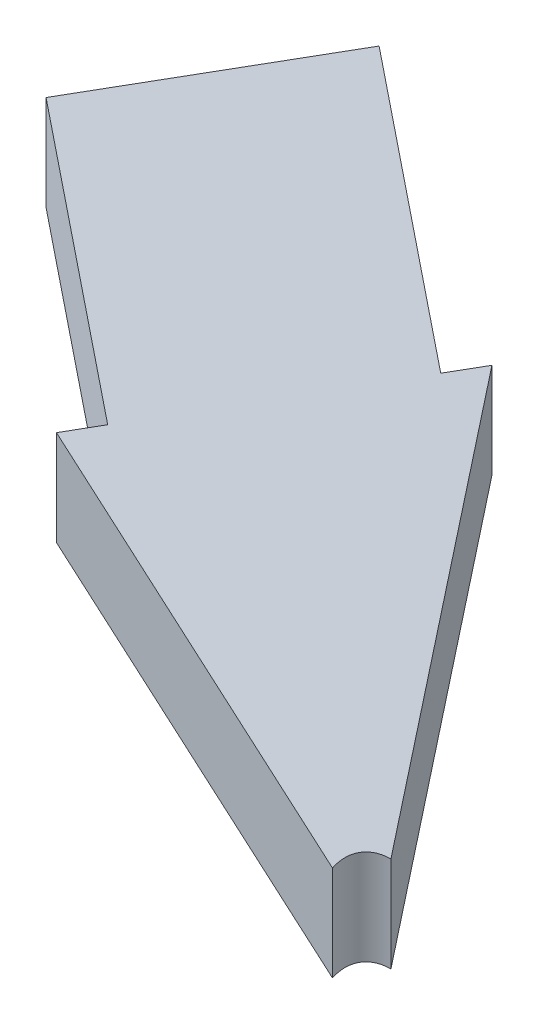
ISO-10303-21;
HEADER;
FILE_DESCRIPTION(('STEP AP214'),'2;1');
FILE_NAME('part.step','',(''),(''),'','','');
FILE_SCHEMA(('AUTOMOTIVE_DESIGN { 1 0 10303 214 1 1 1 1 }'));
ENDSEC;
DATA;
#1=APPLICATION_CONTEXT('core data for automotive mechanical design processes');
#2=APPLICATION_PROTOCOL_DEFINITION('international standard','automotive_design',2000,#1);
#3=PRODUCT_CONTEXT('',#1,'mechanical');
#4=PRODUCT('Part','Part','',(#3));
#5=PRODUCT_RELATED_PRODUCT_CATEGORY('part','',(#4));
#6=PRODUCT_DEFINITION_FORMATION('','',#4);
#7=PRODUCT_DEFINITION_CONTEXT('part definition',#1,'design');
#8=PRODUCT_DEFINITION('design','',#6,#7);
#9=PRODUCT_DEFINITION_SHAPE('','',#8);
#10=(LENGTH_UNIT() NAMED_UNIT(*) SI_UNIT(.MILLI.,.METRE.));
#11=(NAMED_UNIT(*) PLANE_ANGLE_UNIT() SI_UNIT($,.RADIAN.));
#12=(NAMED_UNIT(*) SI_UNIT($,.STERADIAN.) SOLID_ANGLE_UNIT());
#13=UNCERTAINTY_MEASURE_WITH_UNIT(LENGTH_MEASURE(1.E-05),#10,'distance_accuracy_value','');
#14=(GEOMETRIC_REPRESENTATION_CONTEXT(3) GLOBAL_UNCERTAINTY_ASSIGNED_CONTEXT((#13)) GLOBAL_UNIT_ASSIGNED_CONTEXT((#10,
#11,#12)) REPRESENTATION_CONTEXT('',''));
#15=CARTESIAN_POINT('',(0.,0.,0.));
#16=DIRECTION('',(0.,0.,1.));
#17=DIRECTION('',(1.,0.,0.));
#18=AXIS2_PLACEMENT_3D('',#15,#16,#17);
#19=CARTESIAN_POINT('',(0.,254.,0.));
#20=DIRECTION('',(-0.866025403784438,0.,0.5));
#21=DIRECTION('',(0.5,0.,0.866025403784438));
#22=AXIS2_PLACEMENT_3D('',#19,#20,#21);
#23=PLANE('',#22);
#24=DIRECTION('',(0.,-1.,0.));
#25=VECTOR('',#24,1.);
#26=CARTESIAN_POINT('',(-23.6662432702594,80.1332714854436,-40.9911357683742));
#27=LINE('',#26,#25);
#28=CARTESIAN_POINT('',(-23.6662432702594,55.1332714854434,-40.9911357683742));
#29=VERTEX_POINT('',#28);
#30=CARTESIAN_POINT('',(-23.6662432702594,40.9911357683744,-40.9911357683742));
#31=VERTEX_POINT('',#30);
#32=EDGE_CURVE('E142',#29,#31,#27,.T.);
#33=ORIENTED_EDGE('',*,*,#32,.F.);
#34=DIRECTION('',(0.377964473009227,-0.654653670707979,0.654653670707976));
#35=VECTOR('',#34,1.);
#36=CARTESIAN_POINT('',(-59.349429647571,116.938363266897,-102.796227549828));
#37=LINE('',#36,#35);
#38=CARTESIAN_POINT('',(-3.17499999999998,19.6413970311002,-5.4992613140312));
#39=VERTEX_POINT('',#38);
#40=EDGE_CURVE('E163',#29,#39,#37,.T.);
#41=ORIENTED_EDGE('',*,*,#40,.T.);
#42=DIRECTION('',(0.,-1.,0.));
#43=VECTOR('',#42,1.);
#44=CARTESIAN_POINT('',(-3.17499999999998,254.,-5.4992613140312));
#45=LINE('',#44,#43);
#46=CARTESIAN_POINT('',(-3.17499999999998,5.4992613140312,-5.4992613140312));
#47=VERTEX_POINT('',#46);
#48=EDGE_CURVE('E186',#47,#39,#45,.F.);
#49=ORIENTED_EDGE('',*,*,#48,.F.);
#50=DIRECTION('',(0.377964473009227,-0.654653670707979,0.654653670707976));
#51=VECTOR('',#50,1.);
#52=CARTESIAN_POINT('',(-62.848700731785,108.857142857143,-108.857142857143));
#53=LINE('',#52,#51);
#54=EDGE_CURVE('E183',#31,#47,#53,.T.);
#55=ORIENTED_EDGE('',*,*,#54,.F.);
#56=EDGE_LOOP('',(#33,#41,#49,#55));
#57=FACE_BOUND('',#56,.T.);
#58=ADVANCED_FACE('F46',(#57),#23,.F.);
#59=CARTESIAN_POINT('',(0.,254.,0.));
#60=DIRECTION('',(0.,0.,1.));
#61=DIRECTION('',(1.,0.,0.));
#62=AXIS2_PLACEMENT_3D('',#59,#60,#61);
#63=PLANE('',#62);
#64=DIRECTION('',(0.755928946018453,-0.654653670707978,0.));
#65=VECTOR('',#64,1.);
#66=CARTESIAN_POINT('',(-118.698859295142,116.938363266897,0.));
#67=LINE('',#66,#65);
#68=CARTESIAN_POINT('',(-47.3324865405187,55.1332714854434,0.));
#69=VERTEX_POINT('',#68);
#70=CARTESIAN_POINT('',(-6.35,19.6413970311003,0.));
#71=VERTEX_POINT('',#70);
#72=EDGE_CURVE('E166',#69,#71,#67,.T.);
#73=ORIENTED_EDGE('',*,*,#72,.F.);
#74=DIRECTION('',(0.,-1.,0.));
#75=VECTOR('',#74,1.);
#76=CARTESIAN_POINT('',(-47.3324865405187,80.1332714854436,0.));
#77=LINE('',#76,#75);
#78=CARTESIAN_POINT('',(-47.3324865405187,40.9911357683744,0.));
#79=VERTEX_POINT('',#78);
#80=EDGE_CURVE('E130',#69,#79,#77,.T.);
#81=ORIENTED_EDGE('',*,*,#80,.T.);
#82=DIRECTION('',(0.755928946018453,-0.654653670707978,0.));
#83=VECTOR('',#82,1.);
#84=CARTESIAN_POINT('',(-125.69740146357,108.857142857143,0.));
#85=LINE('',#84,#83);
#86=CARTESIAN_POINT('',(-6.34999999999998,5.49926131403115,0.));
#87=VERTEX_POINT('',#86);
#88=EDGE_CURVE('E70',#79,#87,#85,.T.);
#89=ORIENTED_EDGE('',*,*,#88,.T.);
#90=DIRECTION('',(0.,-1.,0.));
#91=VECTOR('',#90,1.);
#92=CARTESIAN_POINT('',(-6.35,254.,0.));
#93=LINE('',#92,#91);
#94=EDGE_CURVE('E190',#87,#71,#93,.F.);
#95=ORIENTED_EDGE('',*,*,#94,.T.);
#96=EDGE_LOOP('',(#73,#81,#89,#95));
#97=FACE_BOUND('',#96,.T.);
#98=ADVANCED_FACE('F216',(#97),#63,.T.);
#99=CARTESIAN_POINT('',(0.,0.,0.));
#100=DIRECTION('',(-0.612372435695796,-0.707106781186546,-0.353553390593274));
#101=DIRECTION('',(0.126826484044323,0.353553390593274,-0.926776695296637));
#102=AXIS2_PLACEMENT_3D('',#99,#100,#101);
#103=PLANE('',#102);
#104=ORIENTED_EDGE('',*,*,#88,.F.);
#105=DIRECTION('',(0.5,0.,-0.866025403784439));
#106=VECTOR('',#105,1.);
#107=CARTESIAN_POINT('',(-35.499364905389,40.9911357683744,-20.4955678841871));
#108=LINE('',#107,#106);
#109=CARTESIAN_POINT('',(-44.5493649053891,40.9911357683744,-4.82050807568875));
#110=VERTEX_POINT('',#109);
#111=EDGE_CURVE('E150',#79,#110,#108,.T.);
#112=ORIENTED_EDGE('',*,*,#111,.T.);
#113=DIRECTION('',(0.612372435695793,-0.707106781186549,0.353553390593274));
#114=VECTOR('',#113,1.);
#115=CARTESIAN_POINT('',(-9.05000000000006,0.,15.6750598084984));
#116=LINE('',#115,#114);
#117=CARTESIAN_POINT('',(-66.2,65.9911357683745,-17.3205080756888));
#118=VERTEX_POINT('',#117);
#119=EDGE_CURVE('E133',#118,#110,#116,.T.);
#120=ORIENTED_EDGE('',*,*,#119,.F.);
#121=DIRECTION('',(-0.5,0.,0.866025403784439));
#122=VECTOR('',#121,1.);
#123=CARTESIAN_POINT('',(-38.1,65.9911357683746,-65.9911357683743));
#124=LINE('',#123,#122);
#125=CARTESIAN_POINT('',(-48.1,65.9911357683745,-48.6706276926854));
#126=VERTEX_POINT('',#125);
#127=EDGE_CURVE('E172',#126,#118,#124,.T.);
#128=ORIENTED_EDGE('',*,*,#127,.F.);
#129=DIRECTION('',(-0.612372435695794,0.707106781186549,-0.353553390593272));
#130=VECTOR('',#129,1.);
#131=CARTESIAN_POINT('',(9.05000000000004,0.,-15.6750598084985));
#132=LINE('',#131,#130);
#133=CARTESIAN_POINT('',(-26.449364905389,40.9911357683744,-36.1706276926855));
#134=VERTEX_POINT('',#133);
#135=EDGE_CURVE('E158',#134,#126,#132,.T.);
#136=ORIENTED_EDGE('',*,*,#135,.F.);
#137=DIRECTION('',(0.5,0.,-0.866025403784439));
#138=VECTOR('',#137,1.);
#139=CARTESIAN_POINT('',(-35.4993649053891,40.9911357683744,-20.4955678841871));
#140=LINE('',#139,#138);
#141=EDGE_CURVE('E139',#134,#31,#140,.T.);
#142=ORIENTED_EDGE('',*,*,#141,.T.);
#143=ORIENTED_EDGE('',*,*,#54,.T.);
#144=CARTESIAN_POINT('',(0.,0.,0.));
#145=DIRECTION('',(-0.612372435695796,-0.707106781186546,-0.353553390593274));
#146=DIRECTION('',(0.612372435695793,-0.707106781186549,0.353553390593273));
#147=AXIS2_PLACEMENT_3D('',#144,#145,#146);
#148=ELLIPSE('',#147,8.98025612106917,6.35);
#149=EDGE_CURVE('E179',#87,#47,#148,.T.);
#150=ORIENTED_EDGE('',*,*,#149,.F.);
#151=EDGE_LOOP('',(#104,#112,#120,#128,#136,#142,#143,#150));
#152=FACE_BOUND('',#151,.T.);
#153=ADVANCED_FACE('F212',(#152),#103,.T.);
#154=CARTESIAN_POINT('',(6.12372439737453,7.07106785853451,3.53553392926727));
#155=DIRECTION('',(-0.612372435695796,-0.707106781186546,-0.353553390593274));
#156=DIRECTION('',(0.126826484044323,0.353553390593274,-0.926776695296637));
#157=AXIS2_PLACEMENT_3D('',#154,#155,#156);
#158=PLANE('',#157);
#159=DIRECTION('',(0.5,0.,-0.866025403784439));
#160=VECTOR('',#159,1.);
#161=CARTESIAN_POINT('',(-35.499364905389,55.1332714854434,-20.4955678841871));
#162=LINE('',#161,#160);
#163=CARTESIAN_POINT('',(-44.5493649053891,55.1332714854435,-4.82050807568875));
#164=VERTEX_POINT('',#163);
#165=EDGE_CURVE('E13',#69,#164,#162,.T.);
#166=ORIENTED_EDGE('',*,*,#165,.F.);
#167=ORIENTED_EDGE('',*,*,#72,.T.);
#168=CARTESIAN_POINT('',(0.,14.1421357170691,0.));
#169=DIRECTION('',(-0.612372435695796,-0.707106781186546,-0.353553390593274));
#170=DIRECTION('',(0.612372435695793,-0.707106781186549,0.353553390593273));
#171=AXIS2_PLACEMENT_3D('',#168,#169,#170);
#172=ELLIPSE('',#171,8.98025612106917,6.35);
#173=EDGE_CURVE('E167',#71,#39,#172,.T.);
#174=ORIENTED_EDGE('',*,*,#173,.T.);
#175=ORIENTED_EDGE('',*,*,#40,.F.);
#176=DIRECTION('',(0.5,0.,-0.866025403784439));
#177=VECTOR('',#176,1.);
#178=CARTESIAN_POINT('',(-35.499364905389,55.1332714854434,-20.4955678841871));
#179=LINE('',#178,#177);
#180=CARTESIAN_POINT('',(-26.449364905389,55.1332714854434,-36.1706276926855));
#181=VERTEX_POINT('',#180);
#182=EDGE_CURVE('E55',#181,#29,#179,.T.);
#183=ORIENTED_EDGE('',*,*,#182,.F.);
#184=DIRECTION('',(-0.612372435695794,0.707106781186549,-0.353553390593272));
#185=VECTOR('',#184,1.);
#186=CARTESIAN_POINT('',(15.1737243973746,7.07106785853453,-12.1395258792312));
#187=LINE('',#186,#185);
#188=CARTESIAN_POINT('',(-48.1,80.1332714854436,-48.6706276926854));
#189=VERTEX_POINT('',#188);
#190=EDGE_CURVE('E123',#181,#189,#187,.T.);
#191=ORIENTED_EDGE('',*,*,#190,.T.);
#192=DIRECTION('',(-0.5,0.,0.866025403784439));
#193=VECTOR('',#192,1.);
#194=CARTESIAN_POINT('',(-57.15,80.1332714854435,-32.9955678841871));
#195=LINE('',#194,#193);
#196=CARTESIAN_POINT('',(-66.2,80.1332714854436,-17.3205080756888));
#197=VERTEX_POINT('',#196);
#198=EDGE_CURVE('E118',#189,#197,#195,.T.);
#199=ORIENTED_EDGE('',*,*,#198,.T.);
#200=DIRECTION('',(0.612372435695793,-0.707106781186549,0.353553390593274));
#201=VECTOR('',#200,1.);
#202=CARTESIAN_POINT('',(-2.92627560262553,7.07106785853452,19.2105937377657));
#203=LINE('',#202,#201);
#204=EDGE_CURVE('E114',#197,#164,#203,.T.);
#205=ORIENTED_EDGE('',*,*,#204,.T.);
#206=EDGE_LOOP('',(#166,#167,#174,#175,#183,#191,#199,#205));
#207=FACE_BOUND('',#206,.T.);
#208=ADVANCED_FACE('F115',(#207),#158,.F.);
#209=CARTESIAN_POINT('',(-38.1,254.,-65.9911357683742));
#210=DIRECTION('',(0.866025403784439,0.,0.5));
#211=DIRECTION('',(0.5,0.,-0.866025403784439));
#212=AXIS2_PLACEMENT_3D('',#209,#210,#211);
#213=PLANE('',#212);
#214=ORIENTED_EDGE('',*,*,#127,.T.);
#215=DIRECTION('',(0.,-1.,0.));
#216=VECTOR('',#215,1.);
#217=CARTESIAN_POINT('',(-66.2,80.1332714854436,-17.3205080756888));
#218=LINE('',#217,#216);
#219=EDGE_CURVE('E155',#197,#118,#218,.T.);
#220=ORIENTED_EDGE('',*,*,#219,.F.);
#221=ORIENTED_EDGE('',*,*,#198,.F.);
#222=DIRECTION('',(0.,-1.,0.));
#223=VECTOR('',#222,1.);
#224=CARTESIAN_POINT('',(-48.1,80.1332714854436,-48.6706276926854));
#225=LINE('',#224,#223);
#226=EDGE_CURVE('E62',#189,#126,#225,.T.);
#227=ORIENTED_EDGE('',*,*,#226,.T.);
#228=EDGE_LOOP('',(#214,#220,#221,#227));
#229=FACE_BOUND('',#228,.T.);
#230=ADVANCED_FACE('F48',(#229),#213,.F.);
#231=CARTESIAN_POINT('',(0.,254.,0.));
#232=DIRECTION('',(0.,-1.,0.));
#233=DIRECTION('',(0.,0.,-1.));
#234=AXIS2_PLACEMENT_3D('',#231,#232,#233);
#235=CYLINDRICAL_SURFACE('',#234,6.35);
#236=ORIENTED_EDGE('',*,*,#173,.F.);
#237=ORIENTED_EDGE('',*,*,#94,.F.);
#238=ORIENTED_EDGE('',*,*,#149,.T.);
#239=ORIENTED_EDGE('',*,*,#48,.T.);
#240=EDGE_LOOP('',(#236,#237,#238,#239));
#241=FACE_BOUND('',#240,.T.);
#242=ADVANCED_FACE('F210',(#241),#235,.F.);
#243=CARTESIAN_POINT('',(-48.1,80.1332714854436,-48.6706276926854));
#244=DIRECTION('',(-0.499999999999998,0.,0.86602540378444));
#245=DIRECTION('',(0.86602540378444,0.,0.499999999999998));
#246=AXIS2_PLACEMENT_3D('',#243,#244,#245);
#247=PLANE('',#246);
#248=ORIENTED_EDGE('',*,*,#135,.T.);
#249=ORIENTED_EDGE('',*,*,#226,.F.);
#250=ORIENTED_EDGE('',*,*,#190,.F.);
#251=DIRECTION('',(0.,-1.,0.));
#252=VECTOR('',#251,1.);
#253=CARTESIAN_POINT('',(-26.449364905389,80.1332714854436,-36.1706276926855));
#254=LINE('',#253,#252);
#255=EDGE_CURVE('E135',#181,#134,#254,.T.);
#256=ORIENTED_EDGE('',*,*,#255,.T.);
#257=EDGE_LOOP('',(#248,#249,#250,#256));
#258=FACE_BOUND('',#257,.T.);
#259=ADVANCED_FACE('F214',(#258),#247,.F.);
#260=CARTESIAN_POINT('',(-48.8794919243113,80.1332714854436,-7.32050807568875));
#261=DIRECTION('',(0.500000000000001,0.,-0.866025403784438));
#262=DIRECTION('',(-0.866025403784438,0.,-0.500000000000001));
#263=AXIS2_PLACEMENT_3D('',#260,#261,#262);
#264=PLANE('',#263);
#265=ORIENTED_EDGE('',*,*,#119,.T.);
#266=DIRECTION('',(0.,-1.,0.));
#267=VECTOR('',#266,1.);
#268=CARTESIAN_POINT('',(-44.549364905389,80.1332714854436,-4.82050807568874));
#269=LINE('',#268,#267);
#270=EDGE_CURVE('E128',#164,#110,#269,.T.);
#271=ORIENTED_EDGE('',*,*,#270,.F.);
#272=ORIENTED_EDGE('',*,*,#204,.F.);
#273=ORIENTED_EDGE('',*,*,#219,.T.);
#274=EDGE_LOOP('',(#265,#271,#272,#273));
#275=FACE_BOUND('',#274,.T.);
#276=ADVANCED_FACE('F131',(#275),#264,.F.);
#277=CARTESIAN_POINT('',(-44.549364905389,80.1332714854436,-4.82050807568874));
#278=DIRECTION('',(-0.866025403784439,0.,-0.5));
#279=DIRECTION('',(-0.5,0.,0.866025403784439));
#280=AXIS2_PLACEMENT_3D('',#277,#278,#279);
#281=PLANE('',#280);
#282=ORIENTED_EDGE('',*,*,#80,.F.);
#283=ORIENTED_EDGE('',*,*,#165,.T.);
#284=ORIENTED_EDGE('',*,*,#270,.T.);
#285=ORIENTED_EDGE('',*,*,#111,.F.);
#286=EDGE_LOOP('',(#282,#283,#284,#285));
#287=FACE_BOUND('',#286,.T.);
#288=ADVANCED_FACE('F127',(#287),#281,.T.);
#289=CARTESIAN_POINT('',(-23.6662432702594,80.1332714854436,-40.9911357683742));
#290=DIRECTION('',(-0.866025403784439,0.,-0.5));
#291=DIRECTION('',(-0.5,0.,0.866025403784439));
#292=AXIS2_PLACEMENT_3D('',#289,#290,#291);
#293=PLANE('',#292);
#294=ORIENTED_EDGE('',*,*,#255,.F.);
#295=ORIENTED_EDGE('',*,*,#182,.T.);
#296=ORIENTED_EDGE('',*,*,#32,.T.);
#297=ORIENTED_EDGE('',*,*,#141,.F.);
#298=EDGE_LOOP('',(#294,#295,#296,#297));
#299=FACE_BOUND('',#298,.T.);
#300=ADVANCED_FACE('F201',(#299),#293,.T.);
#301=CLOSED_SHELL('',(#58,#98,#153,#208,#230,#242,#259,#276,#288,#300));
#302=MANIFOLD_SOLID_BREP('B2',#301);
#303=ADVANCED_BREP_SHAPE_REPRESENTATION('',(#18,#302),#14);
#304=SHAPE_DEFINITION_REPRESENTATION(#9,#303);
ENDSEC;
END-ISO-10303-21;
